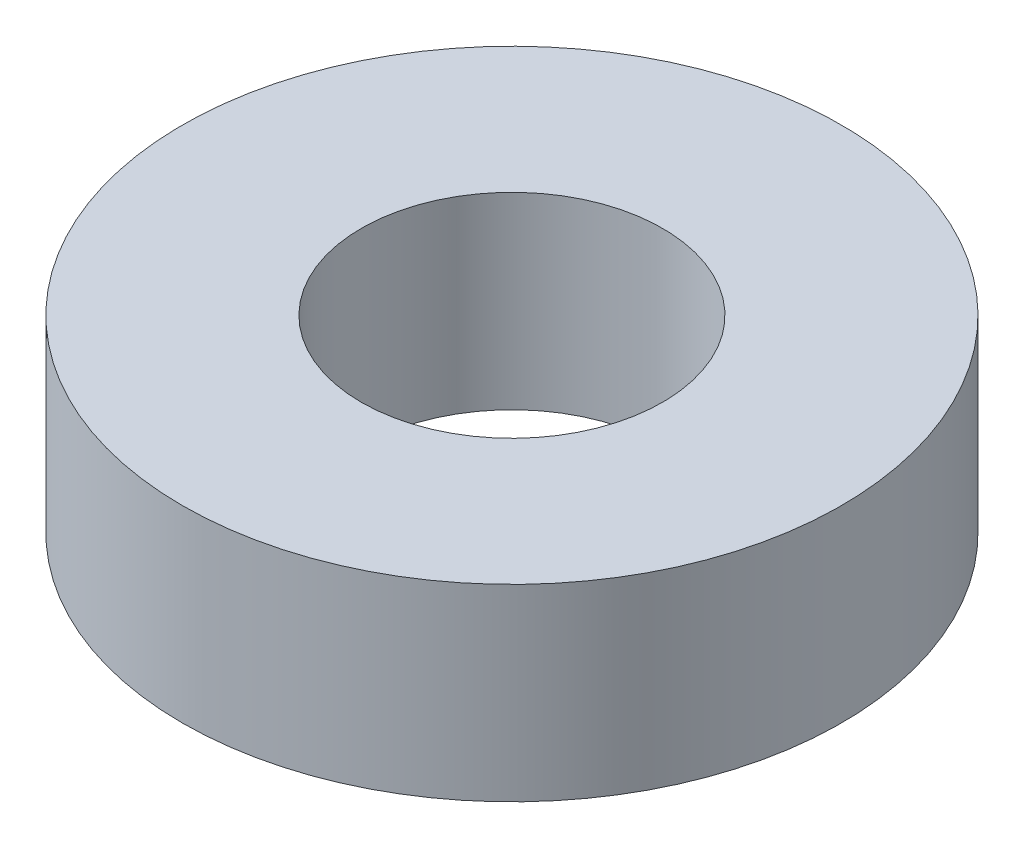
ISO-10303-21;
HEADER;
FILE_DESCRIPTION(('STEP AP214'),'2;1');
FILE_NAME('part.step','',(''),(''),'','','');
FILE_SCHEMA(('AUTOMOTIVE_DESIGN { 1 0 10303 214 1 1 1 1 }'));
ENDSEC;
DATA;
#1=APPLICATION_CONTEXT('core data for automotive mechanical design processes');
#2=APPLICATION_PROTOCOL_DEFINITION('international standard','automotive_design',2000,#1);
#3=PRODUCT_CONTEXT('',#1,'mechanical');
#4=PRODUCT('Part','Part','',(#3));
#5=PRODUCT_RELATED_PRODUCT_CATEGORY('part','',(#4));
#6=PRODUCT_DEFINITION_FORMATION('','',#4);
#7=PRODUCT_DEFINITION_CONTEXT('part definition',#1,'design');
#8=PRODUCT_DEFINITION('design','',#6,#7);
#9=PRODUCT_DEFINITION_SHAPE('','',#8);
#10=(LENGTH_UNIT() NAMED_UNIT(*) SI_UNIT(.MILLI.,.METRE.));
#11=(NAMED_UNIT(*) PLANE_ANGLE_UNIT() SI_UNIT($,.RADIAN.));
#12=(NAMED_UNIT(*) SI_UNIT($,.STERADIAN.) SOLID_ANGLE_UNIT());
#13=UNCERTAINTY_MEASURE_WITH_UNIT(LENGTH_MEASURE(1.E-05),#10,'distance_accuracy_value','');
#14=(GEOMETRIC_REPRESENTATION_CONTEXT(3) GLOBAL_UNCERTAINTY_ASSIGNED_CONTEXT((#13)) GLOBAL_UNIT_ASSIGNED_CONTEXT((#10,
#11,#12)) REPRESENTATION_CONTEXT('',''));
#15=CARTESIAN_POINT('',(0.,0.,0.));
#16=DIRECTION('',(0.,0.,1.));
#17=DIRECTION('',(1.,0.,0.));
#18=AXIS2_PLACEMENT_3D('',#15,#16,#17);
#19=CARTESIAN_POINT('',(0.,2.,0.));
#20=DIRECTION('',(0.,1.,0.));
#21=DIRECTION('',(0.,0.,1.));
#22=AXIS2_PLACEMENT_3D('',#19,#20,#21);
#23=PLANE('',#22);
#24=CARTESIAN_POINT('',(0.,2.,0.));
#25=DIRECTION('',(0.,1.,0.));
#26=DIRECTION('',(0.,0.,1.));
#27=AXIS2_PLACEMENT_3D('',#24,#25,#26);
#28=CIRCLE('',#27,3.5);
#29=CARTESIAN_POINT('',(0.,2.,3.5));
#30=VERTEX_POINT('',#29);
#31=EDGE_CURVE('E10',#30,#30,#28,.T.);
#32=ORIENTED_EDGE('',*,*,#31,.T.);
#33=EDGE_LOOP('',(#32));
#34=FACE_BOUND('',#33,.T.);
#35=CARTESIAN_POINT('',(0.,2.,0.));
#36=DIRECTION('',(0.,1.,0.));
#37=DIRECTION('',(0.,0.,1.));
#38=AXIS2_PLACEMENT_3D('',#35,#36,#37);
#39=CIRCLE('',#38,1.59999999999999);
#40=CARTESIAN_POINT('',(0.,2.,1.59999999999999));
#41=VERTEX_POINT('',#40);
#42=EDGE_CURVE('E43',#41,#41,#39,.T.);
#43=ORIENTED_EDGE('',*,*,#42,.F.);
#44=EDGE_LOOP('',(#43));
#45=FACE_BOUND('',#44,.T.);
#46=ADVANCED_FACE('F32',(#34,#45),#23,.T.);
#47=CARTESIAN_POINT('',(0.,0.,0.));
#48=DIRECTION('',(0.,1.,0.));
#49=DIRECTION('',(0.,0.,1.));
#50=AXIS2_PLACEMENT_3D('',#47,#48,#49);
#51=PLANE('',#50);
#52=CARTESIAN_POINT('',(0.,0.,0.));
#53=DIRECTION('',(0.,1.,0.));
#54=DIRECTION('',(0.,0.,1.));
#55=AXIS2_PLACEMENT_3D('',#52,#53,#54);
#56=CIRCLE('',#55,3.5);
#57=CARTESIAN_POINT('',(0.,0.,3.5));
#58=VERTEX_POINT('',#57);
#59=EDGE_CURVE('E36',#58,#58,#56,.T.);
#60=ORIENTED_EDGE('',*,*,#59,.F.);
#61=EDGE_LOOP('',(#60));
#62=FACE_BOUND('',#61,.T.);
#63=CARTESIAN_POINT('',(0.,0.,0.));
#64=DIRECTION('',(0.,1.,0.));
#65=DIRECTION('',(0.,0.,1.));
#66=AXIS2_PLACEMENT_3D('',#63,#64,#65);
#67=CIRCLE('',#66,1.59999999999999);
#68=CARTESIAN_POINT('',(0.,0.,1.59999999999999));
#69=VERTEX_POINT('',#68);
#70=EDGE_CURVE('E45',#69,#69,#67,.T.);
#71=ORIENTED_EDGE('',*,*,#70,.T.);
#72=EDGE_LOOP('',(#71));
#73=FACE_BOUND('',#72,.T.);
#74=ADVANCED_FACE('F55',(#62,#73),#51,.F.);
#75=CARTESIAN_POINT('',(0.,2.,0.));
#76=DIRECTION('',(0.,-1.,0.));
#77=DIRECTION('',(0.,0.,-1.));
#78=AXIS2_PLACEMENT_3D('',#75,#76,#77);
#79=CYLINDRICAL_SURFACE('',#78,3.5);
#80=ORIENTED_EDGE('',*,*,#31,.F.);
#81=EDGE_LOOP('',(#80));
#82=FACE_BOUND('',#81,.T.);
#83=ORIENTED_EDGE('',*,*,#59,.T.);
#84=EDGE_LOOP('',(#83));
#85=FACE_BOUND('',#84,.T.);
#86=ADVANCED_FACE('F34',(#82,#85),#79,.T.);
#87=CARTESIAN_POINT('',(0.,2.,0.));
#88=DIRECTION('',(0.,-1.,0.));
#89=DIRECTION('',(0.,0.,-1.));
#90=AXIS2_PLACEMENT_3D('',#87,#88,#89);
#91=CYLINDRICAL_SURFACE('',#90,1.59999999999999);
#92=ORIENTED_EDGE('',*,*,#42,.T.);
#93=EDGE_LOOP('',(#92));
#94=FACE_BOUND('',#93,.T.);
#95=ORIENTED_EDGE('',*,*,#70,.F.);
#96=EDGE_LOOP('',(#95));
#97=FACE_BOUND('',#96,.T.);
#98=ADVANCED_FACE('F51',(#94,#97),#91,.F.);
#99=CLOSED_SHELL('',(#46,#74,#86,#98));
#100=MANIFOLD_SOLID_BREP('B2',#99);
#101=ADVANCED_BREP_SHAPE_REPRESENTATION('',(#18,#100),#14);
#102=SHAPE_DEFINITION_REPRESENTATION(#9,#101);
ENDSEC;
END-ISO-10303-21;
